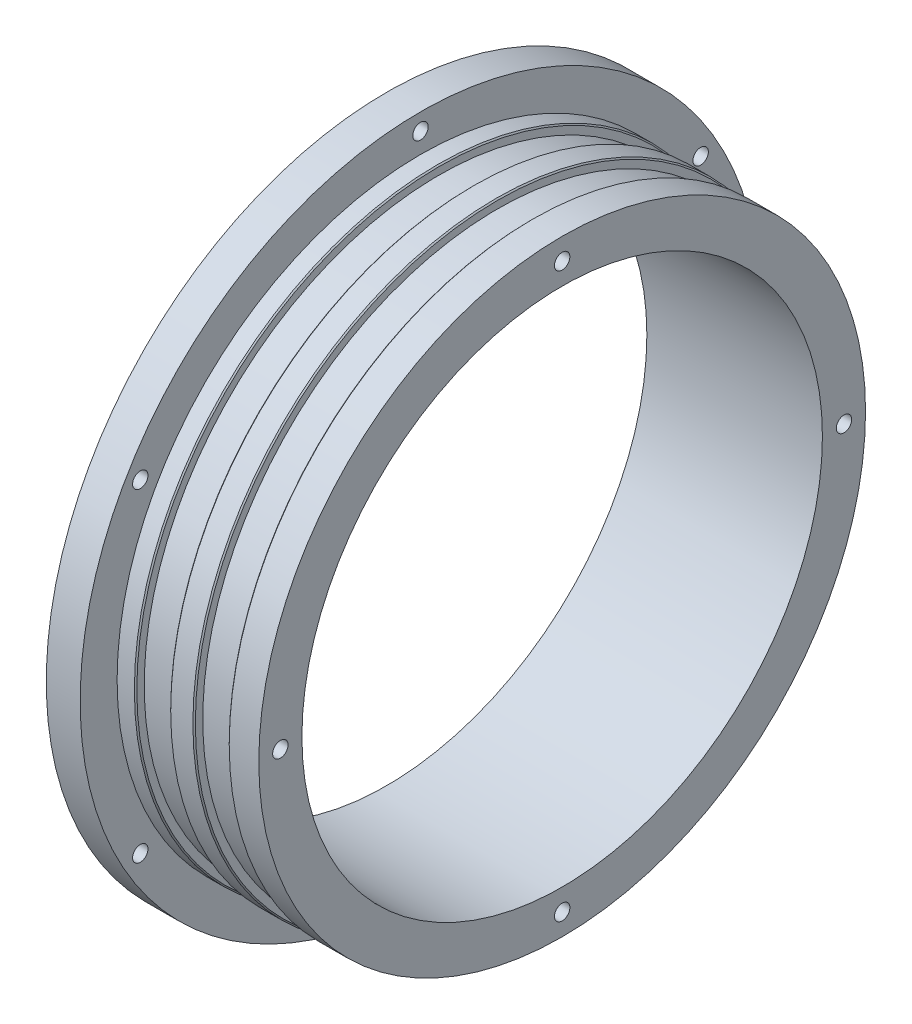
ISO-10303-21;
HEADER;
FILE_DESCRIPTION(('STEP AP214'),'2;1');
FILE_NAME('part.step','',(''),(''),'','','');
FILE_SCHEMA(('AUTOMOTIVE_DESIGN { 1 0 10303 214 1 1 1 1 }'));
ENDSEC;
DATA;
#1=APPLICATION_CONTEXT('core data for automotive mechanical design processes');
#2=APPLICATION_PROTOCOL_DEFINITION('international standard','automotive_design',2000,#1);
#3=PRODUCT_CONTEXT('',#1,'mechanical');
#4=PRODUCT('Part','Part','',(#3));
#5=PRODUCT_RELATED_PRODUCT_CATEGORY('part','',(#4));
#6=PRODUCT_DEFINITION_FORMATION('','',#4);
#7=PRODUCT_DEFINITION_CONTEXT('part definition',#1,'design');
#8=PRODUCT_DEFINITION('design','',#6,#7);
#9=PRODUCT_DEFINITION_SHAPE('','',#8);
#10=(LENGTH_UNIT() NAMED_UNIT(*) SI_UNIT(.MILLI.,.METRE.));
#11=(NAMED_UNIT(*) PLANE_ANGLE_UNIT() SI_UNIT($,.RADIAN.));
#12=(NAMED_UNIT(*) SI_UNIT($,.STERADIAN.) SOLID_ANGLE_UNIT());
#13=UNCERTAINTY_MEASURE_WITH_UNIT(LENGTH_MEASURE(1.E-05),#10,'distance_accuracy_value','');
#14=(GEOMETRIC_REPRESENTATION_CONTEXT(3) GLOBAL_UNCERTAINTY_ASSIGNED_CONTEXT((#13)) GLOBAL_UNIT_ASSIGNED_CONTEXT((#10,
#11,#12)) REPRESENTATION_CONTEXT('',''));
#15=CARTESIAN_POINT('',(0.,0.,0.));
#16=DIRECTION('',(0.,0.,1.));
#17=DIRECTION('',(1.,0.,0.));
#18=AXIS2_PLACEMENT_3D('',#15,#16,#17);
#19=CARTESIAN_POINT('',(-77.6809523145711,0.,-49.8));
#20=DIRECTION('',(-1.,0.,0.));
#21=DIRECTION('',(0.,0.,1.));
#22=AXIS2_PLACEMENT_3D('',#19,#20,#21);
#23=PLANE('',#22);
#24=CARTESIAN_POINT('',(-77.6809523145711,52.525,0.));
#25=DIRECTION('',(-1.,0.,0.));
#26=DIRECTION('',(0.,0.,1.));
#27=AXIS2_PLACEMENT_3D('',#24,#25,#26);
#28=CIRCLE('',#27,1.24999999999999);
#29=CARTESIAN_POINT('',(-77.6809523145711,52.525,1.25));
#30=VERTEX_POINT('',#29);
#31=EDGE_CURVE('E557',#30,#30,#28,.T.);
#32=ORIENTED_EDGE('',*,*,#31,.F.);
#33=EDGE_LOOP('',(#32));
#34=FACE_BOUND('',#33,.T.);
#35=CARTESIAN_POINT('',(-77.6809523145711,26.2625000000071,45.4879843337817));
#36=DIRECTION('',(-1.,0.,0.));
#37=DIRECTION('',(0.,0.,1.));
#38=AXIS2_PLACEMENT_3D('',#35,#36,#37);
#39=CIRCLE('',#38,1.24999999999999);
#40=CARTESIAN_POINT('',(-77.6809523145711,26.2625000000071,46.7379843337817));
#41=VERTEX_POINT('',#40);
#42=EDGE_CURVE('E176',#41,#41,#39,.T.);
#43=ORIENTED_EDGE('',*,*,#42,.F.);
#44=EDGE_LOOP('',(#43));
#45=FACE_BOUND('',#44,.T.);
#46=CARTESIAN_POINT('',(-77.6809523145711,-26.2624999999929,45.48798433379));
#47=DIRECTION('',(-1.,0.,0.));
#48=DIRECTION('',(0.,0.,1.));
#49=AXIS2_PLACEMENT_3D('',#46,#47,#48);
#50=CIRCLE('',#49,1.24999999999999);
#51=CARTESIAN_POINT('',(-77.6809523145711,-26.2624999999929,46.7379843337899));
#52=VERTEX_POINT('',#51);
#53=EDGE_CURVE('E165',#52,#52,#50,.T.);
#54=ORIENTED_EDGE('',*,*,#53,.F.);
#55=EDGE_LOOP('',(#54));
#56=FACE_BOUND('',#55,.T.);
#57=CARTESIAN_POINT('',(-77.6809523145711,-52.525,1.64180014244873E-11));
#58=DIRECTION('',(-1.,0.,0.));
#59=DIRECTION('',(0.,0.,1.));
#60=AXIS2_PLACEMENT_3D('',#57,#58,#59);
#61=CIRCLE('',#60,1.24999999999999);
#62=CARTESIAN_POINT('',(-77.6809523145711,-52.525,1.25000000001641));
#63=VERTEX_POINT('',#62);
#64=EDGE_CURVE('E164',#63,#63,#61,.T.);
#65=ORIENTED_EDGE('',*,*,#64,.F.);
#66=EDGE_LOOP('',(#65));
#67=FACE_BOUND('',#66,.T.);
#68=CARTESIAN_POINT('',(-77.6809523145711,-26.2625000000071,-45.4879843337653));
#69=DIRECTION('',(-1.,0.,0.));
#70=DIRECTION('',(0.,0.,1.));
#71=AXIS2_PLACEMENT_3D('',#68,#69,#70);
#72=CIRCLE('',#71,1.24999999999999);
#73=CARTESIAN_POINT('',(-77.6809523145711,-26.2625000000071,-44.2379843337653));
#74=VERTEX_POINT('',#73);
#75=EDGE_CURVE('E182',#74,#74,#72,.T.);
#76=ORIENTED_EDGE('',*,*,#75,.F.);
#77=EDGE_LOOP('',(#76));
#78=FACE_BOUND('',#77,.T.);
#79=CARTESIAN_POINT('',(-77.6809523145711,26.2624999999929,-45.4879843337735));
#80=DIRECTION('',(-1.,0.,0.));
#81=DIRECTION('',(0.,0.,1.));
#82=AXIS2_PLACEMENT_3D('',#79,#80,#81);
#83=CIRCLE('',#82,1.24999999999999);
#84=CARTESIAN_POINT('',(-77.6809523145711,26.2624999999929,-44.2379843337736));
#85=VERTEX_POINT('',#84);
#86=EDGE_CURVE('E161',#85,#85,#83,.T.);
#87=ORIENTED_EDGE('',*,*,#86,.F.);
#88=EDGE_LOOP('',(#87));
#89=FACE_BOUND('',#88,.T.);
#90=CARTESIAN_POINT('',(-77.6809523145711,0.,0.));
#91=DIRECTION('',(-1.,0.,0.));
#92=DIRECTION('',(0.,0.,1.));
#93=AXIS2_PLACEMENT_3D('',#90,#91,#92);
#94=CIRCLE('',#93,50.);
#95=CARTESIAN_POINT('',(-77.6809523145711,0.,50.));
#96=VERTEX_POINT('',#95);
#97=EDGE_CURVE('E134',#96,#96,#94,.F.);
#98=ORIENTED_EDGE('',*,*,#97,.T.);
#99=EDGE_LOOP('',(#98));
#100=FACE_BOUND('',#99,.T.);
#101=CARTESIAN_POINT('',(-77.6809523145711,0.,0.));
#102=DIRECTION('',(1.,0.,0.));
#103=DIRECTION('',(0.,0.,-1.));
#104=AXIS2_PLACEMENT_3D('',#101,#102,#103);
#105=CIRCLE('',#104,55.25);
#106=CARTESIAN_POINT('',(-77.6809523145711,0.,-55.25));
#107=VERTEX_POINT('',#106);
#108=EDGE_CURVE('E125',#107,#107,#105,.T.);
#109=ORIENTED_EDGE('',*,*,#108,.F.);
#110=EDGE_LOOP('',(#109));
#111=FACE_BOUND('',#110,.T.);
#112=ADVANCED_FACE('F34',(#34,#45,#56,#67,#78,#89,#100,#111),#23,.T.);
#113=CARTESIAN_POINT('',(0.,0.,0.));
#114=DIRECTION('',(1.,0.,0.));
#115=DIRECTION('',(0.,0.,-1.));
#116=AXIS2_PLACEMENT_3D('',#113,#114,#115);
#117=CYLINDRICAL_SURFACE('',#116,55.25);
#118=ORIENTED_EDGE('',*,*,#108,.T.);
#119=EDGE_LOOP('',(#118));
#120=FACE_BOUND('',#119,.T.);
#121=CARTESIAN_POINT('',(-72.1809523145711,0.,0.));
#122=DIRECTION('',(1.,0.,0.));
#123=DIRECTION('',(0.,0.,-1.));
#124=AXIS2_PLACEMENT_3D('',#121,#122,#123);
#125=CIRCLE('',#124,55.25);
#126=CARTESIAN_POINT('',(-72.1809523145711,0.,-55.25));
#127=VERTEX_POINT('',#126);
#128=EDGE_CURVE('E122',#127,#127,#125,.T.);
#129=ORIENTED_EDGE('',*,*,#128,.F.);
#130=EDGE_LOOP('',(#129));
#131=FACE_BOUND('',#130,.T.);
#132=ADVANCED_FACE('F194',(#120,#131),#117,.T.);
#133=CARTESIAN_POINT('',(-72.1809523145711,0.,-55.25));
#134=DIRECTION('',(1.,0.,0.));
#135=DIRECTION('',(0.,0.,-1.));
#136=AXIS2_PLACEMENT_3D('',#133,#134,#135);
#137=PLANE('',#136);
#138=CARTESIAN_POINT('',(-72.1809523145711,52.525,0.));
#139=DIRECTION('',(1.,0.,0.));
#140=DIRECTION('',(0.,0.,-1.));
#141=AXIS2_PLACEMENT_3D('',#138,#139,#140);
#142=CIRCLE('',#141,1.24999999999999);
#143=CARTESIAN_POINT('',(-72.1809523145711,52.525,-1.24999999999998));
#144=VERTEX_POINT('',#143);
#145=EDGE_CURVE('E554',#144,#144,#142,.T.);
#146=ORIENTED_EDGE('',*,*,#145,.F.);
#147=EDGE_LOOP('',(#146));
#148=FACE_BOUND('',#147,.T.);
#149=CARTESIAN_POINT('',(-72.1809523145711,26.2625000000071,45.4879843337817));
#150=DIRECTION('',(1.,0.,0.));
#151=DIRECTION('',(0.,0.,-1.));
#152=AXIS2_PLACEMENT_3D('',#149,#150,#151);
#153=CIRCLE('',#152,1.24999999999999);
#154=CARTESIAN_POINT('',(-72.1809523145711,26.2625000000071,44.2379843337817));
#155=VERTEX_POINT('',#154);
#156=EDGE_CURVE('E38',#155,#155,#153,.T.);
#157=ORIENTED_EDGE('',*,*,#156,.F.);
#158=EDGE_LOOP('',(#157));
#159=FACE_BOUND('',#158,.T.);
#160=CARTESIAN_POINT('',(-72.1809523145711,-26.2624999999929,45.48798433379));
#161=DIRECTION('',(1.,0.,0.));
#162=DIRECTION('',(0.,0.,-1.));
#163=AXIS2_PLACEMENT_3D('',#160,#161,#162);
#164=CIRCLE('',#163,1.24999999999999);
#165=CARTESIAN_POINT('',(-72.1809523145711,-26.2624999999929,44.23798433379));
#166=VERTEX_POINT('',#165);
#167=EDGE_CURVE('E162',#166,#166,#164,.T.);
#168=ORIENTED_EDGE('',*,*,#167,.F.);
#169=EDGE_LOOP('',(#168));
#170=FACE_BOUND('',#169,.T.);
#171=CARTESIAN_POINT('',(-72.1809523145711,-52.525,1.64173278687478E-11));
#172=DIRECTION('',(1.,0.,0.));
#173=DIRECTION('',(0.,0.,-1.));
#174=AXIS2_PLACEMENT_3D('',#171,#172,#173);
#175=CIRCLE('',#174,1.24999999999999);
#176=CARTESIAN_POINT('',(-72.1809523145711,-52.525,-1.24999999998357));
#177=VERTEX_POINT('',#176);
#178=EDGE_CURVE('E169',#177,#177,#175,.T.);
#179=ORIENTED_EDGE('',*,*,#178,.F.);
#180=EDGE_LOOP('',(#179));
#181=FACE_BOUND('',#180,.T.);
#182=CARTESIAN_POINT('',(-72.1809523145711,-26.2625000000071,-45.4879843337653));
#183=DIRECTION('',(1.,0.,0.));
#184=DIRECTION('',(0.,0.,-1.));
#185=AXIS2_PLACEMENT_3D('',#182,#183,#184);
#186=CIRCLE('',#185,1.24999999999999);
#187=CARTESIAN_POINT('',(-72.1809523145711,-26.2625000000071,-46.7379843337653));
#188=VERTEX_POINT('',#187);
#189=EDGE_CURVE('E185',#188,#188,#186,.T.);
#190=ORIENTED_EDGE('',*,*,#189,.F.);
#191=EDGE_LOOP('',(#190));
#192=FACE_BOUND('',#191,.T.);
#193=CARTESIAN_POINT('',(-72.1809523145711,26.2624999999929,-45.4879843337735));
#194=DIRECTION('',(1.,0.,0.));
#195=DIRECTION('',(0.,0.,-1.));
#196=AXIS2_PLACEMENT_3D('',#193,#194,#195);
#197=CIRCLE('',#196,1.24999999999999);
#198=CARTESIAN_POINT('',(-72.1809523145711,26.2624999999929,-46.7379843337735));
#199=VERTEX_POINT('',#198);
#200=EDGE_CURVE('E74',#199,#199,#197,.T.);
#201=ORIENTED_EDGE('',*,*,#200,.F.);
#202=EDGE_LOOP('',(#201));
#203=FACE_BOUND('',#202,.T.);
#204=ORIENTED_EDGE('',*,*,#128,.T.);
#205=EDGE_LOOP('',(#204));
#206=FACE_BOUND('',#205,.T.);
#207=CARTESIAN_POINT('',(-72.1809523145711,0.,0.));
#208=DIRECTION('',(1.,0.,0.));
#209=DIRECTION('',(0.,0.,-1.));
#210=AXIS2_PLACEMENT_3D('',#207,#208,#209);
#211=CIRCLE('',#210,49.25);
#212=CARTESIAN_POINT('',(-72.1809523145711,0.,-49.25));
#213=VERTEX_POINT('',#212);
#214=EDGE_CURVE('E119',#213,#213,#211,.T.);
#215=ORIENTED_EDGE('',*,*,#214,.F.);
#216=EDGE_LOOP('',(#215));
#217=FACE_BOUND('',#216,.T.);
#218=ADVANCED_FACE('F203',(#148,#159,#170,#181,#192,#203,#206,#217),#137,.T.);
#219=CARTESIAN_POINT('',(0.,0.,0.));
#220=DIRECTION('',(1.,0.,0.));
#221=DIRECTION('',(0.,0.,-1.));
#222=AXIS2_PLACEMENT_3D('',#219,#220,#221);
#223=CYLINDRICAL_SURFACE('',#222,49.25);
#224=CARTESIAN_POINT('',(-69.3809523145711,0.,0.));
#225=DIRECTION('',(1.,0.,0.));
#226=DIRECTION('',(0.,0.,-1.));
#227=AXIS2_PLACEMENT_3D('',#224,#225,#226);
#228=CIRCLE('',#227,49.25);
#229=CARTESIAN_POINT('',(-69.3809523145711,0.,-49.25));
#230=VERTEX_POINT('',#229);
#231=EDGE_CURVE('E143',#230,#230,#228,.F.);
#232=ORIENTED_EDGE('',*,*,#231,.T.);
#233=EDGE_LOOP('',(#232));
#234=FACE_BOUND('',#233,.T.);
#235=ORIENTED_EDGE('',*,*,#214,.T.);
#236=EDGE_LOOP('',(#235));
#237=FACE_BOUND('',#236,.T.);
#238=ADVANCED_FACE('F209',(#234,#237),#223,.T.);
#239=CARTESIAN_POINT('',(-69.1809523145711,0.,-49.25));
#240=DIRECTION('',(1.,0.,0.));
#241=DIRECTION('',(0.,0.,-1.));
#242=AXIS2_PLACEMENT_3D('',#239,#240,#241);
#243=PLANE('',#242);
#244=CARTESIAN_POINT('',(-69.1809523145711,0.,0.));
#245=DIRECTION('',(1.,0.,0.));
#246=DIRECTION('',(0.,0.,-1.));
#247=AXIS2_PLACEMENT_3D('',#244,#245,#246);
#248=CIRCLE('',#247,49.0499999999999);
#249=CARTESIAN_POINT('',(-69.1809523145711,0.,-49.0499999999999));
#250=VERTEX_POINT('',#249);
#251=EDGE_CURVE('E140',#250,#250,#248,.T.);
#252=ORIENTED_EDGE('',*,*,#251,.T.);
#253=EDGE_LOOP('',(#252));
#254=FACE_BOUND('',#253,.T.);
#255=CARTESIAN_POINT('',(-69.1809523145711,0.,0.));
#256=DIRECTION('',(1.,0.,0.));
#257=DIRECTION('',(0.,0.,-1.));
#258=AXIS2_PLACEMENT_3D('',#255,#256,#257);
#259=CIRCLE('',#258,47.85);
#260=CARTESIAN_POINT('',(-69.1809523145711,0.,-47.85));
#261=VERTEX_POINT('',#260);
#262=EDGE_CURVE('E116',#261,#261,#259,.T.);
#263=ORIENTED_EDGE('',*,*,#262,.F.);
#264=EDGE_LOOP('',(#263));
#265=FACE_BOUND('',#264,.T.);
#266=ADVANCED_FACE('F215',(#254,#265),#243,.T.);
#267=CARTESIAN_POINT('',(0.,0.,0.));
#268=DIRECTION('',(1.,0.,0.));
#269=DIRECTION('',(0.,0.,-1.));
#270=AXIS2_PLACEMENT_3D('',#267,#268,#269);
#271=CYLINDRICAL_SURFACE('',#270,47.85);
#272=ORIENTED_EDGE('',*,*,#262,.T.);
#273=EDGE_LOOP('',(#272));
#274=FACE_BOUND('',#273,.T.);
#275=CARTESIAN_POINT('',(-63.6809523145711,0.,0.));
#276=DIRECTION('',(1.,0.,0.));
#277=DIRECTION('',(0.,0.,-1.));
#278=AXIS2_PLACEMENT_3D('',#275,#276,#277);
#279=CIRCLE('',#278,47.85);
#280=CARTESIAN_POINT('',(-63.6809523145711,0.,-47.85));
#281=VERTEX_POINT('',#280);
#282=EDGE_CURVE('E113',#281,#281,#279,.T.);
#283=ORIENTED_EDGE('',*,*,#282,.F.);
#284=EDGE_LOOP('',(#283));
#285=FACE_BOUND('',#284,.T.);
#286=ADVANCED_FACE('F221',(#274,#285),#271,.T.);
#287=CARTESIAN_POINT('',(-63.6809523145711,0.,-47.85));
#288=DIRECTION('',(-1.,0.,0.));
#289=DIRECTION('',(0.,0.,1.));
#290=AXIS2_PLACEMENT_3D('',#287,#288,#289);
#291=PLANE('',#290);
#292=CARTESIAN_POINT('',(-63.6809523145711,0.,0.));
#293=DIRECTION('',(-1.,0.,0.));
#294=DIRECTION('',(0.,0.,1.));
#295=AXIS2_PLACEMENT_3D('',#292,#293,#294);
#296=CIRCLE('',#295,49.05);
#297=CARTESIAN_POINT('',(-63.6809523145711,0.,49.05));
#298=VERTEX_POINT('',#297);
#299=EDGE_CURVE('E152',#298,#298,#296,.T.);
#300=ORIENTED_EDGE('',*,*,#299,.T.);
#301=EDGE_LOOP('',(#300));
#302=FACE_BOUND('',#301,.T.);
#303=ORIENTED_EDGE('',*,*,#282,.T.);
#304=EDGE_LOOP('',(#303));
#305=FACE_BOUND('',#304,.T.);
#306=ADVANCED_FACE('F282',(#302,#305),#291,.T.);
#307=CARTESIAN_POINT('',(0.,0.,0.));
#308=DIRECTION('',(1.,0.,0.));
#309=DIRECTION('',(0.,0.,-1.));
#310=AXIS2_PLACEMENT_3D('',#307,#308,#309);
#311=CYLINDRICAL_SURFACE('',#310,49.25);
#312=CARTESIAN_POINT('',(-63.4809523145711,0.,0.));
#313=DIRECTION('',(-1.,0.,0.));
#314=DIRECTION('',(0.,0.,1.));
#315=AXIS2_PLACEMENT_3D('',#312,#313,#314);
#316=CIRCLE('',#315,49.25);
#317=CARTESIAN_POINT('',(-63.4809523145711,0.,49.25));
#318=VERTEX_POINT('',#317);
#319=EDGE_CURVE('E149',#318,#318,#316,.F.);
#320=ORIENTED_EDGE('',*,*,#319,.T.);
#321=EDGE_LOOP('',(#320));
#322=FACE_BOUND('',#321,.T.);
#323=CARTESIAN_POINT('',(-59.880952314571,0.,0.));
#324=DIRECTION('',(1.,0.,0.));
#325=DIRECTION('',(0.,0.,-1.));
#326=AXIS2_PLACEMENT_3D('',#323,#324,#325);
#327=CIRCLE('',#326,49.25);
#328=CARTESIAN_POINT('',(-59.880952314571,0.,-49.25));
#329=VERTEX_POINT('',#328);
#330=EDGE_CURVE('E146',#329,#329,#327,.F.);
#331=ORIENTED_EDGE('',*,*,#330,.T.);
#332=EDGE_LOOP('',(#331));
#333=FACE_BOUND('',#332,.T.);
#334=ADVANCED_FACE('F258',(#322,#333),#311,.T.);
#335=CARTESIAN_POINT('',(-59.6809523145711,0.,-49.25));
#336=DIRECTION('',(1.,0.,0.));
#337=DIRECTION('',(0.,0.,-1.));
#338=AXIS2_PLACEMENT_3D('',#335,#336,#337);
#339=PLANE('',#338);
#340=CARTESIAN_POINT('',(-59.6809523145711,0.,0.));
#341=DIRECTION('',(1.,0.,0.));
#342=DIRECTION('',(0.,0.,-1.));
#343=AXIS2_PLACEMENT_3D('',#340,#341,#342);
#344=CIRCLE('',#343,49.0500000000001);
#345=CARTESIAN_POINT('',(-59.6809523145711,0.,-49.0500000000001));
#346=VERTEX_POINT('',#345);
#347=EDGE_CURVE('E155',#346,#346,#344,.T.);
#348=ORIENTED_EDGE('',*,*,#347,.T.);
#349=EDGE_LOOP('',(#348));
#350=FACE_BOUND('',#349,.T.);
#351=CARTESIAN_POINT('',(-59.6809523145711,0.,0.));
#352=DIRECTION('',(1.,0.,0.));
#353=DIRECTION('',(0.,0.,-1.));
#354=AXIS2_PLACEMENT_3D('',#351,#352,#353);
#355=CIRCLE('',#354,47.85);
#356=CARTESIAN_POINT('',(-59.6809523145711,0.,-47.85));
#357=VERTEX_POINT('',#356);
#358=EDGE_CURVE('E110',#357,#357,#355,.T.);
#359=ORIENTED_EDGE('',*,*,#358,.F.);
#360=EDGE_LOOP('',(#359));
#361=FACE_BOUND('',#360,.T.);
#362=ADVANCED_FACE('F254',(#350,#361),#339,.T.);
#363=CARTESIAN_POINT('',(0.,0.,0.));
#364=DIRECTION('',(1.,0.,0.));
#365=DIRECTION('',(0.,0.,-1.));
#366=AXIS2_PLACEMENT_3D('',#363,#364,#365);
#367=CYLINDRICAL_SURFACE('',#366,47.85);
#368=ORIENTED_EDGE('',*,*,#358,.T.);
#369=EDGE_LOOP('',(#368));
#370=FACE_BOUND('',#369,.T.);
#371=CARTESIAN_POINT('',(-54.1809523145711,0.,0.));
#372=DIRECTION('',(1.,0.,0.));
#373=DIRECTION('',(0.,0.,-1.));
#374=AXIS2_PLACEMENT_3D('',#371,#372,#373);
#375=CIRCLE('',#374,47.85);
#376=CARTESIAN_POINT('',(-54.1809523145711,0.,-47.85));
#377=VERTEX_POINT('',#376);
#378=EDGE_CURVE('E107',#377,#377,#375,.T.);
#379=ORIENTED_EDGE('',*,*,#378,.F.);
#380=EDGE_LOOP('',(#379));
#381=FACE_BOUND('',#380,.T.);
#382=ADVANCED_FACE('F257',(#370,#381),#367,.T.);
#383=CARTESIAN_POINT('',(-54.1809523145711,0.,-47.85));
#384=DIRECTION('',(-1.,0.,0.));
#385=DIRECTION('',(0.,0.,1.));
#386=AXIS2_PLACEMENT_3D('',#383,#384,#385);
#387=PLANE('',#386);
#388=CARTESIAN_POINT('',(-54.1809523145711,0.,0.));
#389=DIRECTION('',(-1.,0.,0.));
#390=DIRECTION('',(0.,0.,1.));
#391=AXIS2_PLACEMENT_3D('',#388,#389,#390);
#392=CIRCLE('',#391,49.05);
#393=CARTESIAN_POINT('',(-54.1809523145711,0.,49.05));
#394=VERTEX_POINT('',#393);
#395=EDGE_CURVE('E11',#394,#394,#392,.T.);
#396=ORIENTED_EDGE('',*,*,#395,.T.);
#397=EDGE_LOOP('',(#396));
#398=FACE_BOUND('',#397,.T.);
#399=ORIENTED_EDGE('',*,*,#378,.T.);
#400=EDGE_LOOP('',(#399));
#401=FACE_BOUND('',#400,.T.);
#402=ADVANCED_FACE('F264',(#398,#401),#387,.T.);
#403=CARTESIAN_POINT('',(0.,0.,0.));
#404=DIRECTION('',(1.,0.,0.));
#405=DIRECTION('',(0.,0.,-1.));
#406=AXIS2_PLACEMENT_3D('',#403,#404,#405);
#407=CYLINDRICAL_SURFACE('',#406,49.25);
#408=CARTESIAN_POINT('',(-53.9809523145711,0.,0.));
#409=DIRECTION('',(-1.,0.,0.));
#410=DIRECTION('',(0.,0.,1.));
#411=AXIS2_PLACEMENT_3D('',#408,#409,#410);
#412=CIRCLE('',#411,49.25);
#413=CARTESIAN_POINT('',(-53.9809523145711,0.,49.25));
#414=VERTEX_POINT('',#413);
#415=EDGE_CURVE('E43',#414,#414,#412,.F.);
#416=ORIENTED_EDGE('',*,*,#415,.T.);
#417=EDGE_LOOP('',(#416));
#418=FACE_BOUND('',#417,.T.);
#419=CARTESIAN_POINT('',(-49.1809523145711,0.,0.));
#420=DIRECTION('',(1.,0.,0.));
#421=DIRECTION('',(0.,0.,-1.));
#422=AXIS2_PLACEMENT_3D('',#419,#420,#421);
#423=CIRCLE('',#422,49.25);
#424=CARTESIAN_POINT('',(-49.1809523145711,0.,-49.25));
#425=VERTEX_POINT('',#424);
#426=EDGE_CURVE('E104',#425,#425,#423,.T.);
#427=ORIENTED_EDGE('',*,*,#426,.F.);
#428=EDGE_LOOP('',(#427));
#429=FACE_BOUND('',#428,.T.);
#430=ADVANCED_FACE('F269',(#418,#429),#407,.T.);
#431=CARTESIAN_POINT('',(-49.1809523145711,0.,-49.25));
#432=DIRECTION('',(1.,0.,0.));
#433=DIRECTION('',(0.,0.,-1.));
#434=AXIS2_PLACEMENT_3D('',#431,#432,#433);
#435=PLANE('',#434);
#436=CARTESIAN_POINT('',(-49.1809523145711,6.49586327309882E-12,-45.7500000000065));
#437=DIRECTION('',(1.,0.,0.));
#438=DIRECTION('',(0.,0.,-1.));
#439=AXIS2_PLACEMENT_3D('',#436,#437,#438);
#440=CIRCLE('',#439,1.24999999999999);
#441=CARTESIAN_POINT('',(-49.1809523145711,6.49586327309882E-12,-47.0000000000065));
#442=VERTEX_POINT('',#441);
#443=EDGE_CURVE('E68',#442,#442,#440,.T.);
#444=ORIENTED_EDGE('',*,*,#443,.F.);
#445=EDGE_LOOP('',(#444));
#446=FACE_BOUND('',#445,.T.);
#447=CARTESIAN_POINT('',(-49.1809523145711,-6.50146603220492E-12,45.7499999999935));
#448=DIRECTION('',(1.,0.,0.));
#449=DIRECTION('',(0.,0.,-1.));
#450=AXIS2_PLACEMENT_3D('',#447,#448,#449);
#451=CIRCLE('',#450,1.24999999999999);
#452=CARTESIAN_POINT('',(-49.1809523145711,-6.50146603220492E-12,44.4999999999935));
#453=VERTEX_POINT('',#452);
#454=EDGE_CURVE('E67',#453,#453,#451,.T.);
#455=ORIENTED_EDGE('',*,*,#454,.F.);
#456=EDGE_LOOP('',(#455));
#457=FACE_BOUND('',#456,.T.);
#458=CARTESIAN_POINT('',(-49.1809523145711,-45.75,-1.29857036166145E-11));
#459=DIRECTION('',(1.,0.,0.));
#460=DIRECTION('',(0.,0.,-1.));
#461=AXIS2_PLACEMENT_3D('',#458,#459,#460);
#462=CIRCLE('',#461,1.24999999999999);
#463=CARTESIAN_POINT('',(-49.1809523145711,-45.75,-1.25000000001297));
#464=VERTEX_POINT('',#463);
#465=EDGE_CURVE('E80',#464,#464,#462,.T.);
#466=ORIENTED_EDGE('',*,*,#465,.F.);
#467=EDGE_LOOP('',(#466));
#468=FACE_BOUND('',#467,.T.);
#469=CARTESIAN_POINT('',(-49.1809523145711,45.75,0.));
#470=DIRECTION('',(1.,0.,0.));
#471=DIRECTION('',(0.,0.,-1.));
#472=AXIS2_PLACEMENT_3D('',#469,#470,#471);
#473=CIRCLE('',#472,1.24999999999999);
#474=CARTESIAN_POINT('',(-49.1809523145711,45.75,-1.24999999999998));
#475=VERTEX_POINT('',#474);
#476=EDGE_CURVE('E86',#475,#475,#473,.T.);
#477=ORIENTED_EDGE('',*,*,#476,.F.);
#478=EDGE_LOOP('',(#477));
#479=FACE_BOUND('',#478,.T.);
#480=ORIENTED_EDGE('',*,*,#426,.T.);
#481=EDGE_LOOP('',(#480));
#482=FACE_BOUND('',#481,.T.);
#483=CARTESIAN_POINT('',(-49.1809523145711,0.,0.));
#484=DIRECTION('',(1.,0.,0.));
#485=DIRECTION('',(0.,0.,-1.));
#486=AXIS2_PLACEMENT_3D('',#483,#484,#485);
#487=CIRCLE('',#486,42.25);
#488=CARTESIAN_POINT('',(-49.1809523145711,0.,-42.25));
#489=VERTEX_POINT('',#488);
#490=EDGE_CURVE('E101',#489,#489,#487,.T.);
#491=ORIENTED_EDGE('',*,*,#490,.F.);
#492=EDGE_LOOP('',(#491));
#493=FACE_BOUND('',#492,.T.);
#494=ADVANCED_FACE('F275',(#446,#457,#468,#479,#482,#493),#435,.T.);
#495=CARTESIAN_POINT('',(0.,0.,0.));
#496=DIRECTION('',(1.,0.,0.));
#497=DIRECTION('',(0.,0.,-1.));
#498=AXIS2_PLACEMENT_3D('',#495,#496,#497);
#499=CYLINDRICAL_SURFACE('',#498,42.25);
#500=ORIENTED_EDGE('',*,*,#490,.T.);
#501=EDGE_LOOP('',(#500));
#502=FACE_BOUND('',#501,.T.);
#503=CARTESIAN_POINT('',(-77.6809523145711,0.,0.));
#504=DIRECTION('',(1.,0.,0.));
#505=DIRECTION('',(0.,0.,-1.));
#506=AXIS2_PLACEMENT_3D('',#503,#504,#505);
#507=CIRCLE('',#506,42.25);
#508=CARTESIAN_POINT('',(-77.6809523145711,0.,-42.25));
#509=VERTEX_POINT('',#508);
#510=EDGE_CURVE('E98',#509,#509,#507,.T.);
#511=ORIENTED_EDGE('',*,*,#510,.F.);
#512=EDGE_LOOP('',(#511));
#513=FACE_BOUND('',#512,.T.);
#514=ADVANCED_FACE('F320',(#502,#513),#499,.F.);
#515=CARTESIAN_POINT('',(-77.6809523145711,0.,-42.25));
#516=DIRECTION('',(-1.,0.,0.));
#517=DIRECTION('',(0.,0.,1.));
#518=AXIS2_PLACEMENT_3D('',#515,#516,#517);
#519=PLANE('',#518);
#520=CARTESIAN_POINT('',(-77.6809523145711,0.,0.));
#521=DIRECTION('',(-1.,0.,0.));
#522=DIRECTION('',(0.,0.,1.));
#523=AXIS2_PLACEMENT_3D('',#520,#521,#522);
#524=CIRCLE('',#523,46.);
#525=CARTESIAN_POINT('',(-77.6809523145711,0.,46.));
#526=VERTEX_POINT('',#525);
#527=EDGE_CURVE('E131',#526,#526,#524,.T.);
#528=ORIENTED_EDGE('',*,*,#527,.T.);
#529=EDGE_LOOP('',(#528));
#530=FACE_BOUND('',#529,.T.);
#531=ORIENTED_EDGE('',*,*,#510,.T.);
#532=EDGE_LOOP('',(#531));
#533=FACE_BOUND('',#532,.T.);
#534=ADVANCED_FACE('F325',(#530,#533),#519,.T.);
#535=CARTESIAN_POINT('',(0.,0.,0.));
#536=DIRECTION('',(1.,0.,0.));
#537=DIRECTION('',(0.,0.,-1.));
#538=AXIS2_PLACEMENT_3D('',#535,#536,#537);
#539=CYLINDRICAL_SURFACE('',#538,46.2);
#540=CARTESIAN_POINT('',(-77.480952314571,0.,0.));
#541=DIRECTION('',(-1.,0.,0.));
#542=DIRECTION('',(0.,0.,1.));
#543=AXIS2_PLACEMENT_3D('',#540,#541,#542);
#544=CIRCLE('',#543,46.2);
#545=CARTESIAN_POINT('',(-77.480952314571,0.,46.2));
#546=VERTEX_POINT('',#545);
#547=EDGE_CURVE('E128',#546,#546,#544,.F.);
#548=ORIENTED_EDGE('',*,*,#547,.T.);
#549=EDGE_LOOP('',(#548));
#550=FACE_BOUND('',#549,.T.);
#551=CARTESIAN_POINT('',(-76.7809523145711,0.,0.));
#552=DIRECTION('',(1.,0.,0.));
#553=DIRECTION('',(0.,0.,-1.));
#554=AXIS2_PLACEMENT_3D('',#551,#552,#553);
#555=CIRCLE('',#554,46.2);
#556=CARTESIAN_POINT('',(-76.7809523145711,0.,-46.2));
#557=VERTEX_POINT('',#556);
#558=EDGE_CURVE('E95',#557,#557,#555,.T.);
#559=ORIENTED_EDGE('',*,*,#558,.F.);
#560=EDGE_LOOP('',(#559));
#561=FACE_BOUND('',#560,.T.);
#562=ADVANCED_FACE('F339',(#550,#561),#539,.T.);
#563=CARTESIAN_POINT('',(-76.7809523145711,0.,-46.2));
#564=DIRECTION('',(-1.,0.,0.));
#565=DIRECTION('',(0.,0.,1.));
#566=AXIS2_PLACEMENT_3D('',#563,#564,#565);
#567=PLANE('',#566);
#568=ORIENTED_EDGE('',*,*,#558,.T.);
#569=EDGE_LOOP('',(#568));
#570=FACE_BOUND('',#569,.T.);
#571=CARTESIAN_POINT('',(-76.7809523145711,0.,0.));
#572=DIRECTION('',(1.,0.,0.));
#573=DIRECTION('',(0.,0.,-1.));
#574=AXIS2_PLACEMENT_3D('',#571,#572,#573);
#575=CIRCLE('',#574,49.8);
#576=CARTESIAN_POINT('',(-76.7809523145711,0.,-49.8));
#577=VERTEX_POINT('',#576);
#578=EDGE_CURVE('E92',#577,#577,#575,.T.);
#579=ORIENTED_EDGE('',*,*,#578,.F.);
#580=EDGE_LOOP('',(#579));
#581=FACE_BOUND('',#580,.T.);
#582=ADVANCED_FACE('F335',(#570,#581),#567,.T.);
#583=CARTESIAN_POINT('',(0.,0.,0.));
#584=DIRECTION('',(1.,0.,0.));
#585=DIRECTION('',(0.,0.,-1.));
#586=AXIS2_PLACEMENT_3D('',#583,#584,#585);
#587=CYLINDRICAL_SURFACE('',#586,49.8);
#588=CARTESIAN_POINT('',(-77.4809523145711,0.,0.));
#589=DIRECTION('',(-1.,0.,0.));
#590=DIRECTION('',(0.,0.,1.));
#591=AXIS2_PLACEMENT_3D('',#588,#589,#590);
#592=CIRCLE('',#591,49.8);
#593=CARTESIAN_POINT('',(-77.4809523145711,0.,49.8));
#594=VERTEX_POINT('',#593);
#595=EDGE_CURVE('E137',#594,#594,#592,.T.);
#596=ORIENTED_EDGE('',*,*,#595,.T.);
#597=EDGE_LOOP('',(#596));
#598=FACE_BOUND('',#597,.T.);
#599=ORIENTED_EDGE('',*,*,#578,.T.);
#600=EDGE_LOOP('',(#599));
#601=FACE_BOUND('',#600,.T.);
#602=ADVANCED_FACE('F230',(#598,#601),#587,.F.);
#603=CARTESIAN_POINT('',(-77.480952314571,0.,0.));
#604=DIRECTION('',(1.,0.,0.));
#605=DIRECTION('',(0.,0.,-1.));
#606=AXIS2_PLACEMENT_3D('',#603,#604,#605);
#607=CONICAL_SURFACE('',#606,46.2,0.785398163397431);
#608=ORIENTED_EDGE('',*,*,#527,.F.);
#609=EDGE_LOOP('',(#608));
#610=FACE_BOUND('',#609,.T.);
#611=ORIENTED_EDGE('',*,*,#547,.F.);
#612=EDGE_LOOP('',(#611));
#613=FACE_BOUND('',#612,.T.);
#614=ADVANCED_FACE('F226',(#610,#613),#607,.T.);
#615=CARTESIAN_POINT('',(-77.6809523145711,0.,0.));
#616=DIRECTION('',(-1.,0.,0.));
#617=DIRECTION('',(0.,0.,1.));
#618=AXIS2_PLACEMENT_3D('',#615,#616,#617);
#619=CONICAL_SURFACE('',#618,50.,0.785398163397414);
#620=ORIENTED_EDGE('',*,*,#595,.F.);
#621=EDGE_LOOP('',(#620));
#622=FACE_BOUND('',#621,.T.);
#623=ORIENTED_EDGE('',*,*,#97,.F.);
#624=EDGE_LOOP('',(#623));
#625=FACE_BOUND('',#624,.T.);
#626=ADVANCED_FACE('F229',(#622,#625),#619,.F.);
#627=CARTESIAN_POINT('',(-69.1809523145711,0.,0.));
#628=DIRECTION('',(-1.,0.,0.));
#629=DIRECTION('',(0.,0.,1.));
#630=AXIS2_PLACEMENT_3D('',#627,#628,#629);
#631=CONICAL_SURFACE('',#630,49.0499999999999,0.785398163397466);
#632=ORIENTED_EDGE('',*,*,#231,.F.);
#633=EDGE_LOOP('',(#632));
#634=FACE_BOUND('',#633,.T.);
#635=ORIENTED_EDGE('',*,*,#251,.F.);
#636=EDGE_LOOP('',(#635));
#637=FACE_BOUND('',#636,.T.);
#638=ADVANCED_FACE('F234',(#634,#637),#631,.T.);
#639=CARTESIAN_POINT('',(-63.4809523145711,0.,0.));
#640=DIRECTION('',(1.,0.,0.));
#641=DIRECTION('',(0.,0.,-1.));
#642=AXIS2_PLACEMENT_3D('',#639,#640,#641);
#643=CONICAL_SURFACE('',#642,49.25,0.785398163397448);
#644=ORIENTED_EDGE('',*,*,#299,.F.);
#645=EDGE_LOOP('',(#644));
#646=FACE_BOUND('',#645,.T.);
#647=ORIENTED_EDGE('',*,*,#319,.F.);
#648=EDGE_LOOP('',(#647));
#649=FACE_BOUND('',#648,.T.);
#650=ADVANCED_FACE('F238',(#646,#649),#643,.T.);
#651=CARTESIAN_POINT('',(-59.6809523145711,0.,0.));
#652=DIRECTION('',(-1.,0.,0.));
#653=DIRECTION('',(0.,0.,1.));
#654=AXIS2_PLACEMENT_3D('',#651,#652,#653);
#655=CONICAL_SURFACE('',#654,49.0500000000001,0.785398163397414);
#656=ORIENTED_EDGE('',*,*,#330,.F.);
#657=EDGE_LOOP('',(#656));
#658=FACE_BOUND('',#657,.T.);
#659=ORIENTED_EDGE('',*,*,#347,.F.);
#660=EDGE_LOOP('',(#659));
#661=FACE_BOUND('',#660,.T.);
#662=ADVANCED_FACE('F241',(#658,#661),#655,.T.);
#663=CARTESIAN_POINT('',(-53.9809523145711,0.,0.));
#664=DIRECTION('',(1.,0.,0.));
#665=DIRECTION('',(0.,0.,-1.));
#666=AXIS2_PLACEMENT_3D('',#663,#664,#665);
#667=CONICAL_SURFACE('',#666,49.25,0.785398163397466);
#668=ORIENTED_EDGE('',*,*,#395,.F.);
#669=EDGE_LOOP('',(#668));
#670=FACE_BOUND('',#669,.T.);
#671=ORIENTED_EDGE('',*,*,#415,.F.);
#672=EDGE_LOOP('',(#671));
#673=FACE_BOUND('',#672,.T.);
#674=ADVANCED_FACE('F36',(#670,#673),#667,.T.);
#675=CARTESIAN_POINT('',(-53.1809523145711,45.75,0.));
#676=DIRECTION('',(1.,0.,0.));
#677=DIRECTION('',(0.,0.,-1.));
#678=AXIS2_PLACEMENT_3D('',#675,#676,#677);
#679=CONICAL_SURFACE('',#678,1.25,1.02974425867666);
#680=CARTESIAN_POINT('',(-53.9320280883555,45.75,0.));
#681=VERTEX_POINT('',#680);
#682=VERTEX_LOOP('',#681);
#683=FACE_BOUND('',#682,.T.);
#684=CARTESIAN_POINT('',(-53.1809523145711,45.75,0.));
#685=DIRECTION('',(1.,0.,0.));
#686=DIRECTION('',(0.,0.,-1.));
#687=AXIS2_PLACEMENT_3D('',#684,#685,#686);
#688=CIRCLE('',#687,1.25);
#689=CARTESIAN_POINT('',(-53.1809523145711,45.75,-1.24999999999999));
#690=VERTEX_POINT('',#689);
#691=EDGE_CURVE('E89',#690,#690,#688,.T.);
#692=ORIENTED_EDGE('',*,*,#691,.T.);
#693=EDGE_LOOP('',(#692));
#694=FACE_BOUND('',#693,.T.);
#695=ADVANCED_FACE('F248',(#683,#694),#679,.F.);
#696=CARTESIAN_POINT('',(-49.1809523145711,45.75,0.));
#697=DIRECTION('',(1.,0.,0.));
#698=DIRECTION('',(0.,0.,-1.));
#699=AXIS2_PLACEMENT_3D('',#696,#697,#698);
#700=CYLINDRICAL_SURFACE('',#699,1.24999999999999);
#701=ORIENTED_EDGE('',*,*,#691,.F.);
#702=EDGE_LOOP('',(#701));
#703=FACE_BOUND('',#702,.T.);
#704=ORIENTED_EDGE('',*,*,#476,.T.);
#705=EDGE_LOOP('',(#704));
#706=FACE_BOUND('',#705,.T.);
#707=ADVANCED_FACE('F436',(#703,#706),#700,.F.);
#708=CARTESIAN_POINT('',(-53.1809523145711,-45.75,-1.29852137578949E-11));
#709=DIRECTION('',(1.,0.,0.));
#710=DIRECTION('',(0.,0.,-1.));
#711=AXIS2_PLACEMENT_3D('',#708,#709,#710);
#712=CONICAL_SURFACE('',#711,1.25,1.02974425867666);
#713=CARTESIAN_POINT('',(-53.9320280883555,-45.75,-1.29851217776406E-11));
#714=VERTEX_POINT('',#713);
#715=VERTEX_LOOP('',#714);
#716=FACE_BOUND('',#715,.T.);
#717=CARTESIAN_POINT('',(-53.1809523145711,-45.75,-1.29852137578949E-11));
#718=DIRECTION('',(1.,0.,0.));
#719=DIRECTION('',(0.,0.,-1.));
#720=AXIS2_PLACEMENT_3D('',#717,#718,#719);
#721=CIRCLE('',#720,1.25);
#722=CARTESIAN_POINT('',(-53.1809523145711,-45.75,-1.25000000001299));
#723=VERTEX_POINT('',#722);
#724=EDGE_CURVE('E83',#723,#723,#721,.T.);
#725=ORIENTED_EDGE('',*,*,#724,.T.);
#726=EDGE_LOOP('',(#725));
#727=FACE_BOUND('',#726,.T.);
#728=ADVANCED_FACE('F425',(#716,#727),#712,.F.);
#729=CARTESIAN_POINT('',(-49.1809523145711,-45.75,-1.29857036166145E-11));
#730=DIRECTION('',(1.,0.,0.));
#731=DIRECTION('',(0.,0.,-1.));
#732=AXIS2_PLACEMENT_3D('',#729,#730,#731);
#733=CYLINDRICAL_SURFACE('',#732,1.24999999999999);
#734=ORIENTED_EDGE('',*,*,#724,.F.);
#735=EDGE_LOOP('',(#734));
#736=FACE_BOUND('',#735,.T.);
#737=ORIENTED_EDGE('',*,*,#465,.T.);
#738=EDGE_LOOP('',(#737));
#739=FACE_BOUND('',#738,.T.);
#740=ADVANCED_FACE('F415',(#736,#739),#733,.F.);
#741=CARTESIAN_POINT('',(-53.1809523145711,-6.50146603220492E-12,45.7499999999935));
#742=DIRECTION('',(1.,0.,0.));
#743=DIRECTION('',(0.,0.,-1.));
#744=AXIS2_PLACEMENT_3D('',#741,#742,#743);
#745=CONICAL_SURFACE('',#744,1.25,1.02974425867665);
#746=CARTESIAN_POINT('',(-53.9320280883555,-6.50262971015269E-12,45.7499999999935));
#747=VERTEX_POINT('',#746);
#748=VERTEX_LOOP('',#747);
#749=FACE_BOUND('',#748,.T.);
#750=CARTESIAN_POINT('',(-53.1809523145711,-6.50146603220492E-12,45.7499999999935));
#751=DIRECTION('',(1.,0.,0.));
#752=DIRECTION('',(0.,0.,-1.));
#753=AXIS2_PLACEMENT_3D('',#750,#751,#752);
#754=CIRCLE('',#753,1.25);
#755=CARTESIAN_POINT('',(-53.1809523145711,-6.50146603220492E-12,44.4999999999935));
#756=VERTEX_POINT('',#755);
#757=EDGE_CURVE('E71',#756,#756,#754,.T.);
#758=ORIENTED_EDGE('',*,*,#757,.T.);
#759=EDGE_LOOP('',(#758));
#760=FACE_BOUND('',#759,.T.);
#761=ADVANCED_FACE('F404',(#749,#760),#745,.F.);
#762=CARTESIAN_POINT('',(-49.1809523145711,-6.50146603220492E-12,45.7499999999935));
#763=DIRECTION('',(1.,0.,0.));
#764=DIRECTION('',(0.,0.,-1.));
#765=AXIS2_PLACEMENT_3D('',#762,#763,#764);
#766=CYLINDRICAL_SURFACE('',#765,1.24999999999999);
#767=ORIENTED_EDGE('',*,*,#757,.F.);
#768=EDGE_LOOP('',(#767));
#769=FACE_BOUND('',#768,.T.);
#770=ORIENTED_EDGE('',*,*,#454,.T.);
#771=EDGE_LOOP('',(#770));
#772=FACE_BOUND('',#771,.T.);
#773=ADVANCED_FACE('F61',(#769,#772),#766,.F.);
#774=CARTESIAN_POINT('',(-53.1809523145711,6.49586327309882E-12,-45.7500000000065));
#775=DIRECTION('',(1.,0.,0.));
#776=DIRECTION('',(0.,0.,-1.));
#777=AXIS2_PLACEMENT_3D('',#774,#775,#776);
#778=CONICAL_SURFACE('',#777,1.25,1.02974425867665);
#779=CARTESIAN_POINT('',(-53.9320280883556,6.49469959515104E-12,-45.7500000000065));
#780=VERTEX_POINT('',#779);
#781=VERTEX_LOOP('',#780);
#782=FACE_BOUND('',#781,.T.);
#783=CARTESIAN_POINT('',(-53.1809523145711,6.49586327309882E-12,-45.7500000000065));
#784=DIRECTION('',(1.,0.,0.));
#785=DIRECTION('',(0.,0.,-1.));
#786=AXIS2_PLACEMENT_3D('',#783,#784,#785);
#787=CIRCLE('',#786,1.25);
#788=CARTESIAN_POINT('',(-53.1809523145711,6.49586327309882E-12,-47.0000000000065));
#789=VERTEX_POINT('',#788);
#790=EDGE_CURVE('E65',#789,#789,#787,.T.);
#791=ORIENTED_EDGE('',*,*,#790,.T.);
#792=EDGE_LOOP('',(#791));
#793=FACE_BOUND('',#792,.T.);
#794=ADVANCED_FACE('F57',(#782,#793),#778,.F.);
#795=CARTESIAN_POINT('',(-49.1809523145711,6.49586327309882E-12,-45.7500000000065));
#796=DIRECTION('',(1.,0.,0.));
#797=DIRECTION('',(0.,0.,-1.));
#798=AXIS2_PLACEMENT_3D('',#795,#796,#797);
#799=CYLINDRICAL_SURFACE('',#798,1.24999999999999);
#800=ORIENTED_EDGE('',*,*,#790,.F.);
#801=EDGE_LOOP('',(#800));
#802=FACE_BOUND('',#801,.T.);
#803=ORIENTED_EDGE('',*,*,#443,.T.);
#804=EDGE_LOOP('',(#803));
#805=FACE_BOUND('',#804,.T.);
#806=ADVANCED_FACE('F60',(#802,#805),#799,.F.);
#807=CARTESIAN_POINT('',(-77.6809523145711,26.2624999999929,-45.4879843337735));
#808=DIRECTION('',(-1.,0.,0.));
#809=DIRECTION('',(0.,0.,1.));
#810=AXIS2_PLACEMENT_3D('',#807,#808,#809);
#811=CYLINDRICAL_SURFACE('',#810,1.24999999999999);
#812=ORIENTED_EDGE('',*,*,#200,.T.);
#813=EDGE_LOOP('',(#812));
#814=FACE_BOUND('',#813,.T.);
#815=ORIENTED_EDGE('',*,*,#86,.T.);
#816=EDGE_LOOP('',(#815));
#817=FACE_BOUND('',#816,.T.);
#818=ADVANCED_FACE('F190',(#814,#817),#811,.F.);
#819=CARTESIAN_POINT('',(-77.6809523145711,-26.2625000000071,-45.4879843337653));
#820=DIRECTION('',(-1.,0.,0.));
#821=DIRECTION('',(0.,0.,1.));
#822=AXIS2_PLACEMENT_3D('',#819,#820,#821);
#823=CYLINDRICAL_SURFACE('',#822,1.24999999999999);
#824=ORIENTED_EDGE('',*,*,#189,.T.);
#825=EDGE_LOOP('',(#824));
#826=FACE_BOUND('',#825,.T.);
#827=ORIENTED_EDGE('',*,*,#75,.T.);
#828=EDGE_LOOP('',(#827));
#829=FACE_BOUND('',#828,.T.);
#830=ADVANCED_FACE('F531',(#826,#829),#823,.F.);
#831=CARTESIAN_POINT('',(-77.6809523145711,-52.525,1.64180014244873E-11));
#832=DIRECTION('',(-1.,0.,0.));
#833=DIRECTION('',(0.,0.,1.));
#834=AXIS2_PLACEMENT_3D('',#831,#832,#833);
#835=CYLINDRICAL_SURFACE('',#834,1.24999999999999);
#836=ORIENTED_EDGE('',*,*,#178,.T.);
#837=EDGE_LOOP('',(#836));
#838=FACE_BOUND('',#837,.T.);
#839=ORIENTED_EDGE('',*,*,#64,.T.);
#840=EDGE_LOOP('',(#839));
#841=FACE_BOUND('',#840,.T.);
#842=ADVANCED_FACE('F535',(#838,#841),#835,.F.);
#843=CARTESIAN_POINT('',(-77.6809523145711,-26.2624999999929,45.48798433379));
#844=DIRECTION('',(-1.,0.,0.));
#845=DIRECTION('',(0.,0.,1.));
#846=AXIS2_PLACEMENT_3D('',#843,#844,#845);
#847=CYLINDRICAL_SURFACE('',#846,1.24999999999999);
#848=ORIENTED_EDGE('',*,*,#167,.T.);
#849=EDGE_LOOP('',(#848));
#850=FACE_BOUND('',#849,.T.);
#851=ORIENTED_EDGE('',*,*,#53,.T.);
#852=EDGE_LOOP('',(#851));
#853=FACE_BOUND('',#852,.T.);
#854=ADVANCED_FACE('F539',(#850,#853),#847,.F.);
#855=CARTESIAN_POINT('',(-77.6809523145711,26.2625000000071,45.4879843337817));
#856=DIRECTION('',(-1.,0.,0.));
#857=DIRECTION('',(0.,0.,1.));
#858=AXIS2_PLACEMENT_3D('',#855,#856,#857);
#859=CYLINDRICAL_SURFACE('',#858,1.24999999999999);
#860=ORIENTED_EDGE('',*,*,#156,.T.);
#861=EDGE_LOOP('',(#860));
#862=FACE_BOUND('',#861,.T.);
#863=ORIENTED_EDGE('',*,*,#42,.T.);
#864=EDGE_LOOP('',(#863));
#865=FACE_BOUND('',#864,.T.);
#866=ADVANCED_FACE('F543',(#862,#865),#859,.F.);
#867=CARTESIAN_POINT('',(-77.6809523145711,52.525,0.));
#868=DIRECTION('',(-1.,0.,0.));
#869=DIRECTION('',(0.,0.,1.));
#870=AXIS2_PLACEMENT_3D('',#867,#868,#869);
#871=CYLINDRICAL_SURFACE('',#870,1.24999999999999);
#872=ORIENTED_EDGE('',*,*,#145,.T.);
#873=EDGE_LOOP('',(#872));
#874=FACE_BOUND('',#873,.T.);
#875=ORIENTED_EDGE('',*,*,#31,.T.);
#876=EDGE_LOOP('',(#875));
#877=FACE_BOUND('',#876,.T.);
#878=ADVANCED_FACE('F546',(#874,#877),#871,.F.);
#879=CLOSED_SHELL('',(#112,#132,#218,#238,#266,#286,#306,#334,#362,#382,#402,#430,#494,#514,
#534,#562,#582,#602,#614,#626,#638,#650,#662,#674,#695,#707,#728,#740,#761,#773,#794,#806,#818,
#830,#842,#854,#866,#878));
#880=MANIFOLD_SOLID_BREP('B2',#879);
#881=ADVANCED_BREP_SHAPE_REPRESENTATION('',(#18,#880),#14);
#882=SHAPE_DEFINITION_REPRESENTATION(#9,#881);
ENDSEC;
END-ISO-10303-21;
